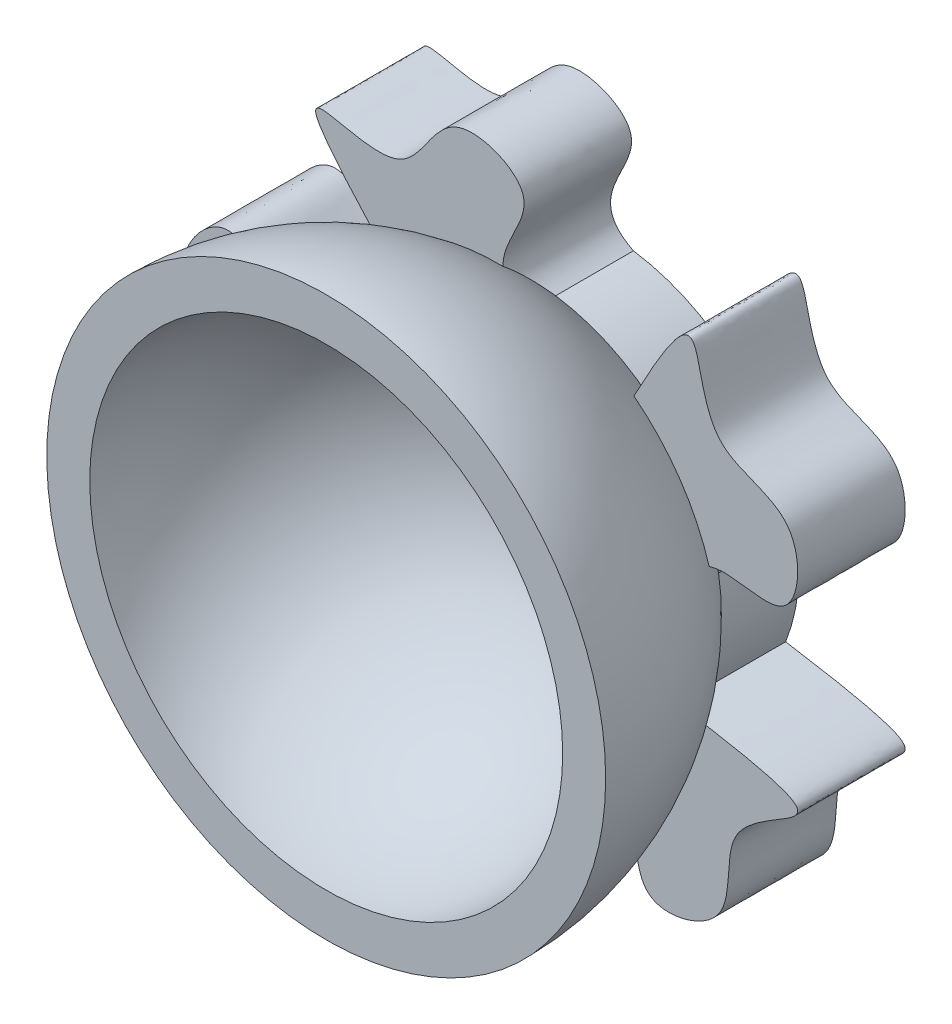
ISO-10303-21;
HEADER;
FILE_DESCRIPTION(('STEP AP214'),'2;1');
FILE_NAME('part.step','',(''),(''),'','','');
FILE_SCHEMA(('AUTOMOTIVE_DESIGN { 1 0 10303 214 1 1 1 1 }'));
ENDSEC;
DATA;
#1=APPLICATION_CONTEXT('core data for automotive mechanical design processes');
#2=APPLICATION_PROTOCOL_DEFINITION('international standard','automotive_design',2000,#1);
#3=PRODUCT_CONTEXT('',#1,'mechanical');
#4=PRODUCT('Part','Part','',(#3));
#5=PRODUCT_RELATED_PRODUCT_CATEGORY('part','',(#4));
#6=PRODUCT_DEFINITION_FORMATION('','',#4);
#7=PRODUCT_DEFINITION_CONTEXT('part definition',#1,'design');
#8=PRODUCT_DEFINITION('design','',#6,#7);
#9=PRODUCT_DEFINITION_SHAPE('','',#8);
#10=(LENGTH_UNIT() NAMED_UNIT(*) SI_UNIT(.MILLI.,.METRE.));
#11=(NAMED_UNIT(*) PLANE_ANGLE_UNIT() SI_UNIT($,.RADIAN.));
#12=(NAMED_UNIT(*) SI_UNIT($,.STERADIAN.) SOLID_ANGLE_UNIT());
#13=UNCERTAINTY_MEASURE_WITH_UNIT(LENGTH_MEASURE(1.E-05),#10,'distance_accuracy_value','');
#14=(GEOMETRIC_REPRESENTATION_CONTEXT(3) GLOBAL_UNCERTAINTY_ASSIGNED_CONTEXT((#13)) GLOBAL_UNIT_ASSIGNED_CONTEXT((#10,
#11,#12)) REPRESENTATION_CONTEXT('',''));
#15=CARTESIAN_POINT('',(0.,0.,0.));
#16=DIRECTION('',(0.,0.,1.));
#17=DIRECTION('',(1.,0.,0.));
#18=AXIS2_PLACEMENT_3D('',#15,#16,#17);
#19=CARTESIAN_POINT('',(0.,0.,0.));
#20=DIRECTION('',(0.,0.,1.));
#21=DIRECTION('',(1.,0.,0.));
#22=AXIS2_PLACEMENT_3D('',#19,#20,#21);
#23=CYLINDRICAL_SURFACE('',#22,18.);
#24=CARTESIAN_POINT('',(0.,0.,-18.7616630392937));
#25=DIRECTION('',(0.,0.,1.));
#26=DIRECTION('',(1.,0.,0.));
#27=AXIS2_PLACEMENT_3D('',#24,#25,#26);
#28=CIRCLE('',#27,18.);
#29=CARTESIAN_POINT('',(11.4569199249378,13.883046705733,-18.7616630392937));
#30=VERTEX_POINT('',#29);
#31=CARTESIAN_POINT('',(2.58343114033743,17.8136431855793,-18.7616630392937));
#32=VERTEX_POINT('',#31);
#33=EDGE_CURVE('E240',#30,#32,#28,.T.);
#34=ORIENTED_EDGE('',*,*,#33,.F.);
#35=DIRECTION('',(0.,0.,-1.));
#36=VECTOR('',#35,1.);
#37=CARTESIAN_POINT('',(11.4569199249378,13.883046705733,-16.));
#38=LINE('',#37,#36);
#39=CARTESIAN_POINT('',(11.4569199249378,13.883046705733,-26.));
#40=VERTEX_POINT('',#39);
#41=EDGE_CURVE('E154',#30,#40,#38,.T.);
#42=ORIENTED_EDGE('',*,*,#41,.T.);
#43=CARTESIAN_POINT('',(0.,0.,-26.));
#44=DIRECTION('',(0.,0.,1.));
#45=DIRECTION('',(1.,0.,0.));
#46=AXIS2_PLACEMENT_3D('',#43,#44,#45);
#47=CIRCLE('',#46,18.);
#48=CARTESIAN_POINT('',(2.58343114033743,17.8136431855793,-26.));
#49=VERTEX_POINT('',#48);
#50=EDGE_CURVE('E164',#40,#49,#47,.T.);
#51=ORIENTED_EDGE('',*,*,#50,.T.);
#52=DIRECTION('',(0.,0.,-1.));
#53=VECTOR('',#52,1.);
#54=CARTESIAN_POINT('',(2.58343114033743,17.8136431855793,-16.));
#55=LINE('',#54,#53);
#56=EDGE_CURVE('E217',#32,#49,#55,.T.);
#57=ORIENTED_EDGE('',*,*,#56,.F.);
#58=EDGE_LOOP('',(#34,#42,#51,#57));
#59=FACE_BOUND('',#58,.T.);
#60=ADVANCED_FACE('F33',(#59),#23,.T.);
#61=CARTESIAN_POINT('',(16.743944995516,-6.6060809855113,-26.));
#62=VERTEX_POINT('',#61);
#63=CARTESIAN_POINT('',(17.7401055567636,3.04772945565794,-26.));
#64=VERTEX_POINT('',#63);
#65=EDGE_CURVE('E162',#62,#64,#47,.T.);
#66=ORIENTED_EDGE('',*,*,#65,.T.);
#67=DIRECTION('',(0.,0.,-1.));
#68=VECTOR('',#67,1.);
#69=CARTESIAN_POINT('',(17.7401055567636,3.04772945565794,-16.));
#70=LINE('',#69,#68);
#71=CARTESIAN_POINT('',(17.7401055567636,3.04772945565794,-18.7616630392937));
#72=VERTEX_POINT('',#71);
#73=EDGE_CURVE('E145',#72,#64,#70,.T.);
#74=ORIENTED_EDGE('',*,*,#73,.F.);
#75=CARTESIAN_POINT('',(16.743944995516,-6.6060809855113,-18.7616630392937));
#76=VERTEX_POINT('',#75);
#77=EDGE_CURVE('E243',#76,#72,#28,.T.);
#78=ORIENTED_EDGE('',*,*,#77,.F.);
#79=DIRECTION('',(0.,0.,-1.));
#80=VECTOR('',#79,1.);
#81=CARTESIAN_POINT('',(16.743944995516,-6.6060809855113,-16.));
#82=LINE('',#81,#80);
#83=EDGE_CURVE('E168',#76,#62,#82,.T.);
#84=ORIENTED_EDGE('',*,*,#83,.T.);
#85=EDGE_LOOP('',(#66,#74,#78,#84));
#86=FACE_BOUND('',#85,.T.);
#87=ADVANCED_FACE('F167',(#86),#23,.T.);
#88=CARTESIAN_POINT('',(-1.10859281195028,-17.9658292872133,-26.));
#89=VERTEX_POINT('',#88);
#90=CARTESIAN_POINT('',(8.38055705775352,-15.9300427934685,-26.));
#91=VERTEX_POINT('',#90);
#92=EDGE_CURVE('E169',#89,#91,#47,.T.);
#93=ORIENTED_EDGE('',*,*,#92,.T.);
#94=DIRECTION('',(0.,0.,-1.));
#95=VECTOR('',#94,1.);
#96=CARTESIAN_POINT('',(8.38055705775352,-15.9300427934685,-16.));
#97=LINE('',#96,#95);
#98=CARTESIAN_POINT('',(8.38055705775352,-15.9300427934685,-18.7616630392937));
#99=VERTEX_POINT('',#98);
#100=EDGE_CURVE('E274',#99,#91,#97,.T.);
#101=ORIENTED_EDGE('',*,*,#100,.F.);
#102=CARTESIAN_POINT('',(-1.10859281195028,-17.9658292872133,-18.7616630392937));
#103=VERTEX_POINT('',#102);
#104=EDGE_CURVE('E249',#103,#99,#28,.T.);
#105=ORIENTED_EDGE('',*,*,#104,.F.);
#106=DIRECTION('',(0.,0.,-1.));
#107=VECTOR('',#106,1.);
#108=CARTESIAN_POINT('',(-1.10859281195028,-17.9658292872133,-16.));
#109=LINE('',#108,#107);
#110=EDGE_CURVE('E272',#103,#89,#109,.T.);
#111=ORIENTED_EDGE('',*,*,#110,.T.);
#112=EDGE_LOOP('',(#93,#101,#105,#111));
#113=FACE_BOUND('',#112,.T.);
#114=ADVANCED_FACE('F271',(#113),#23,.T.);
#115=CARTESIAN_POINT('',(-17.4290930329851,-4.49741215006473,-26.));
#116=VERTEX_POINT('',#115);
#117=CARTESIAN_POINT('',(-12.5606364504142,-12.8930373442617,-26.));
#118=VERTEX_POINT('',#117);
#119=EDGE_CURVE('E172',#116,#118,#47,.T.);
#120=ORIENTED_EDGE('',*,*,#119,.T.);
#121=DIRECTION('',(0.,0.,-1.));
#122=VECTOR('',#121,1.);
#123=CARTESIAN_POINT('',(-12.5606364504142,-12.8930373442617,-16.));
#124=LINE('',#123,#122);
#125=CARTESIAN_POINT('',(-12.5606364504142,-12.8930373442617,-18.7616630392937));
#126=VERTEX_POINT('',#125);
#127=EDGE_CURVE('E289',#126,#118,#124,.T.);
#128=ORIENTED_EDGE('',*,*,#127,.F.);
#129=CARTESIAN_POINT('',(-17.4290930329851,-4.49741215006473,-18.7616630392937));
#130=VERTEX_POINT('',#129);
#131=EDGE_CURVE('E251',#130,#126,#28,.T.);
#132=ORIENTED_EDGE('',*,*,#131,.F.);
#133=DIRECTION('',(0.,0.,-1.));
#134=VECTOR('',#133,1.);
#135=CARTESIAN_POINT('',(-17.4290930329851,-4.49741215006473,-16.));
#136=LINE('',#135,#134);
#137=EDGE_CURVE('E227',#130,#116,#136,.T.);
#138=ORIENTED_EDGE('',*,*,#137,.T.);
#139=EDGE_LOOP('',(#120,#128,#132,#138));
#140=FACE_BOUND('',#139,.T.);
#141=ADVANCED_FACE('F386',(#140),#23,.T.);
#142=CARTESIAN_POINT('',(0.,0.,0.));
#143=DIRECTION('',(0.,0.,1.));
#144=DIRECTION('',(-1.,0.,0.));
#145=AXIS2_PLACEMENT_3D('',#142,#143,#144);
#146=SPHERICAL_SURFACE('',#145,22.);
#147=CARTESIAN_POINT('',(0.,0.,0.));
#148=DIRECTION('',(0.,0.,1.));
#149=DIRECTION('',(1.,0.,0.));
#150=AXIS2_PLACEMENT_3D('',#147,#148,#149);
#151=CIRCLE('',#150,22.);
#152=CARTESIAN_POINT('',(22.,0.,0.));
#153=VERTEX_POINT('',#152);
#154=EDGE_CURVE('E234',#153,#153,#151,.T.);
#155=ORIENTED_EDGE('',*,*,#154,.T.);
#156=EDGE_LOOP('',(#155));
#157=FACE_BOUND('',#156,.T.);
#158=ADVANCED_FACE('F35',(#157),#146,.F.);
#159=CARTESIAN_POINT('',(0.,0.,-26.));
#160=DIRECTION('',(0.,0.,1.));
#161=DIRECTION('',(1.,0.,0.));
#162=AXIS2_PLACEMENT_3D('',#159,#160,#161);
#163=PLANE('',#162);
#164=CARTESIAN_POINT('',(-9.66317907551841,15.1862757170566,-26.));
#165=VERTEX_POINT('',#164);
#166=CARTESIAN_POINT('',(-16.1434573044402,7.96170749649315,-26.));
#167=VERTEX_POINT('',#166);
#168=EDGE_CURVE('E174',#165,#167,#47,.T.);
#169=ORIENTED_EDGE('',*,*,#168,.F.);
#170=CARTESIAN_POINT('',(-9.66317907551858,15.1862757170565,-26.));
#171=CARTESIAN_POINT('',(-24.013315635792,30.5865265173562,-26.));
#172=CARTESIAN_POINT('',(-8.68596371666601,18.103803450049,-26.));
#173=CARTESIAN_POINT('',(-5.37214905115755,31.8277498548278,-26.));
#174=CARTESIAN_POINT('',(6.8260953298461,26.9418160387639,-26.));
#175=CARTESIAN_POINT('',(-2.47743169321801,20.4092820156076,-26.));
#176=CARTESIAN_POINT('',(2.58343114033722,17.8136431855793,-26.));
#177=B_SPLINE_CURVE_WITH_KNOTS('',3,(#170,#171,#172,#173,#174,#175,#176),.UNSPECIFIED.,.F.,.F.,
(4,1,1,1,4),(0.,0.400605418784854,0.590770361322168,0.750468384788745,1.),.UNSPECIFIED.);
#178=EDGE_CURVE('E218',#165,#49,#177,.T.);
#179=ORIENTED_EDGE('',*,*,#178,.T.);
#180=ORIENTED_EDGE('',*,*,#50,.F.);
#181=CARTESIAN_POINT('',(11.4569199249378,13.883046705733,-26.));
#182=CARTESIAN_POINT('',(20.5535698925656,31.6328988008904,-26.));
#183=CARTESIAN_POINT('',(15.5173750141015,14.7777565631501,-26.));
#184=CARTESIAN_POINT('',(28.506978187392,14.7238321875629,-26.));
#185=CARTESIAN_POINT('',(27.7787843764547,1.89089119187956,-26.));
#186=CARTESIAN_POINT('',(18.6267082976742,8.64050154117533,-26.));
#187=CARTESIAN_POINT('',(17.7401055567636,3.04772945565794,-26.));
#188=B_SPLINE_CURVE_WITH_KNOTS('',3,(#181,#182,#183,#184,#185,#186,#187),.UNSPECIFIED.,.F.,.F.,
(4,1,1,1,4),(0.,0.400040512535518,0.587196796291636,0.748289369952448,1.),.UNSPECIFIED.);
#189=EDGE_CURVE('E148',#40,#64,#188,.T.);
#190=ORIENTED_EDGE('',*,*,#189,.T.);
#191=ORIENTED_EDGE('',*,*,#65,.F.);
#192=CARTESIAN_POINT('',(16.743944995516,-6.60608098551127,-26.));
#193=CARTESIAN_POINT('',(36.436076925768,-9.77250326863447,-26.));
#194=CARTESIAN_POINT('',(18.8496142630539,-10.1913227062076,-26.));
#195=CARTESIAN_POINT('',(22.812337264998,-22.5618329967212,-26.));
#196=CARTESIAN_POINT('',(10.3824608450439,-25.8348763831806,-26.));
#197=CARTESIAN_POINT('',(13.9735747080392,-15.0449904874861,-26.));
#198=CARTESIAN_POINT('',(8.38055705775356,-15.9300427934685,-26.));
#199=B_SPLINE_CURVE_WITH_KNOTS('',3,(#192,#193,#194,#195,#196,#197,#198),.UNSPECIFIED.,.F.,.F.,
(4,1,1,1,4),(0.,0.400040512535518,0.587196796291637,0.748289369952448,1.),.UNSPECIFIED.);
#200=EDGE_CURVE('E279',#62,#91,#199,.T.);
#201=ORIENTED_EDGE('',*,*,#200,.T.);
#202=ORIENTED_EDGE('',*,*,#92,.F.);
#203=CARTESIAN_POINT('',(-1.10859281195019,-17.9658292872133,-26.));
#204=CARTESIAN_POINT('',(1.96516406426458,-37.672637976076,-26.));
#205=CARTESIAN_POINT('',(-3.86767272470951,-21.0763403859049,-26.));
#206=CARTESIAN_POINT('',(-14.4081783947975,-28.6678118280354,-26.));
#207=CARTESIAN_POINT('',(-21.3620706873527,-17.857722891837,-26.));
#208=CARTESIAN_POINT('',(-9.99056418377024,-17.9388170228605,-26.));
#209=CARTESIAN_POINT('',(-12.5606364504141,-12.8930373442618,-26.));
#210=B_SPLINE_CURVE_WITH_KNOTS('',3,(#203,#204,#205,#206,#207,#208,#209),.UNSPECIFIED.,.F.,.F.,
(4,1,1,1,4),(0.,0.400040512535519,0.587196796291637,0.748289369952449,1.),.UNSPECIFIED.);
#211=EDGE_CURVE('E277',#89,#118,#210,.T.);
#212=ORIENTED_EDGE('',*,*,#211,.T.);
#213=ORIENTED_EDGE('',*,*,#119,.F.);
#214=CARTESIAN_POINT('',(-17.4290930329851,-4.49741215006487,-26.));
#215=CARTESIAN_POINT('',(-35.2215387405827,-13.5104674464503,-26.));
#216=CARTESIAN_POINT('',(-21.2399674642853,-2.8345720107436,-26.));
#217=CARTESIAN_POINT('',(-31.7170812289547,4.84415090390927,-26.));
#218=CARTESIAN_POINT('',(-23.5849465999056,14.7981966743484,-26.));
#219=CARTESIAN_POINT('',(-20.1480829403965,3.95819184939327,-26.));
#220=CARTESIAN_POINT('',(-16.1434573044403,7.96170749649302,-26.));
#221=B_SPLINE_CURVE_WITH_KNOTS('',3,(#214,#215,#216,#217,#218,#219,#220),.UNSPECIFIED.,.F.,.F.,
(4,1,1,1,4),(0.,0.400040512535519,0.587196796291638,0.748289369952449,1.),.UNSPECIFIED.);
#222=EDGE_CURVE('E404',#116,#167,#221,.T.);
#223=ORIENTED_EDGE('',*,*,#222,.T.);
#224=EDGE_LOOP('',(#169,#179,#180,#190,#191,#201,#202,#212,#213,#223));
#225=FACE_BOUND('',#224,.T.);
#226=ADVANCED_FACE('F160',(#225),#163,.F.);
#227=ORIENTED_EDGE('',*,*,#168,.T.);
#228=DIRECTION('',(0.,0.,-1.));
#229=VECTOR('',#228,1.);
#230=CARTESIAN_POINT('',(-16.1434573044402,7.96170749649315,-16.));
#231=LINE('',#230,#229);
#232=CARTESIAN_POINT('',(-16.1434573044402,7.96170749649315,-18.7616630392937));
#233=VERTEX_POINT('',#232);
#234=EDGE_CURVE('E219',#233,#167,#231,.T.);
#235=ORIENTED_EDGE('',*,*,#234,.F.);
#236=CARTESIAN_POINT('',(-9.66317907551841,15.1862757170566,-18.7616630392937));
#237=VERTEX_POINT('',#236);
#238=EDGE_CURVE('E173',#237,#233,#28,.T.);
#239=ORIENTED_EDGE('',*,*,#238,.F.);
#240=DIRECTION('',(0.,0.,-1.));
#241=VECTOR('',#240,1.);
#242=CARTESIAN_POINT('',(-9.66317907551841,15.1862757170566,-16.));
#243=LINE('',#242,#241);
#244=EDGE_CURVE('E228',#237,#165,#243,.T.);
#245=ORIENTED_EDGE('',*,*,#244,.T.);
#246=EDGE_LOOP('',(#227,#235,#239,#245));
#247=FACE_BOUND('',#246,.T.);
#248=ADVANCED_FACE('F380',(#247),#23,.T.);
#249=CARTESIAN_POINT('',(0.,0.,0.));
#250=DIRECTION('',(0.,0.,1.));
#251=DIRECTION('',(-1.,0.,0.));
#252=AXIS2_PLACEMENT_3D('',#249,#250,#251);
#253=SPHERICAL_SURFACE('',#252,26.);
#254=ORIENTED_EDGE('',*,*,#77,.T.);
#255=CARTESIAN_POINT('',(17.7401055567636,3.04772945565792,-18.7616630392937));
#256=CARTESIAN_POINT('',(17.7509138919469,3.11591256068419,-18.7403675625229));
#257=CARTESIAN_POINT('',(17.762572806785,3.18361136286988,-18.7179285422996));
#258=CARTESIAN_POINT('',(17.7876876426541,3.31790717215349,-18.6706959137359));
#259=CARTESIAN_POINT('',(17.8011450249245,3.38450323330495,-18.6459003955436));
#260=CARTESIAN_POINT('',(17.8299381349842,3.51636147809571,-18.5939167238656));
#261=CARTESIAN_POINT('',(17.8452742383676,3.58162339195899,-18.5667280922549));
#262=CARTESIAN_POINT('',(17.8778338513743,3.7103382899067,-18.5100414989566));
#263=CARTESIAN_POINT('',(17.8950497588669,3.77379734135349,-18.4805529672259));
#264=CARTESIAN_POINT('',(17.9314751939256,3.8989400734999,-18.4191653293943));
#265=CARTESIAN_POINT('',(17.9506843386993,3.96062409219103,-18.3872666864633));
#266=CARTESIAN_POINT('',(17.9911421741128,4.08200382529401,-18.3210599316743));
#267=CARTESIAN_POINT('',(18.0123909842957,4.14169942288965,-18.2867516786227));
#268=CARTESIAN_POINT('',(18.0610834789379,4.2697420744739,-18.2091696039357));
#269=CARTESIAN_POINT('',(18.0889451268742,4.33763976260524,-18.1654132445722));
#270=CARTESIAN_POINT('',(18.1475564544554,4.46995493609152,-18.0746506180986));
#271=CARTESIAN_POINT('',(18.1783068468208,4.53437155637802,-18.0276435497218));
#272=CARTESIAN_POINT('',(18.2426167269497,4.65936848680798,-17.930547033953));
#273=CARTESIAN_POINT('',(18.2761762336464,4.71994877109027,-17.8804575657867));
#274=CARTESIAN_POINT('',(18.3460609651515,4.83714004717053,-17.7772736565673));
#275=CARTESIAN_POINT('',(18.3823931996327,4.89374023374181,-17.7241716928245));
#276=CARTESIAN_POINT('',(18.4575543586348,5.0025851615084,-17.6153388806883));
#277=CARTESIAN_POINT('',(18.4963832784491,5.05482991091375,-17.5596080372508));
#278=CARTESIAN_POINT('',(18.5762887053968,5.15482926156606,-17.4458179930094));
#279=CARTESIAN_POINT('',(18.6173646641946,5.20258495059598,-17.3877593611617));
#280=CARTESIAN_POINT('',(18.7078909138776,5.30049992786854,-17.2606269287751));
#281=CARTESIAN_POINT('',(18.7576662146577,5.34992455081787,-17.191218385103));
#282=CARTESIAN_POINT('',(18.8594394797751,5.44292183615721,-17.0500991427711));
#283=CARTESIAN_POINT('',(18.9114385052876,5.48649166258017,-16.9783873491431));
#284=CARTESIAN_POINT('',(19.0172515497963,5.5680292043949,-16.8330314190139));
#285=CARTESIAN_POINT('',(19.0710672119387,5.60599167155716,-16.7593855472728));
#286=CARTESIAN_POINT('',(19.1800387811636,5.67659083827018,-16.6106042971062));
#287=CARTESIAN_POINT('',(19.2351942389789,5.70922929552787,-16.5354694194965));
#288=CARTESIAN_POINT('',(19.3464368777923,5.76956612843454,-16.3840536024777));
#289=CARTESIAN_POINT('',(19.4025231261422,5.7972691570371,-16.3077738168183));
#290=CARTESIAN_POINT('',(19.5151906391443,5.84812422188209,-16.1544560570866));
#291=CARTESIAN_POINT('',(19.5717698312335,5.87129009490101,-16.077421165021));
#292=CARTESIAN_POINT('',(19.6285269558117,5.89244682156511,-16.));
#293=B_SPLINE_CURVE_WITH_KNOTS('',3,(#255,#256,#257,#258,#259,#260,#261,#262,#263,#264,#265,
#266,#267,#268,#269,#270,#271,#272,#273,#274,#275,#276,#277,#278,#279,#280,#281,#282,#283,#284,
#285,#286,#287,#288,#289,#290,#291,#292),.UNSPECIFIED.,.F.,.F.,(4,2,2,2,2,2,2,2,2,2,2,2,2,2,2,2,
2,2,4),(0.,0.216728320920888,0.433633814643095,0.650582743141824,0.866684707796222,
1.08274524755853,1.29881845818754,1.55497437940821,1.81119366707632,2.06741468176375,
2.32430638780545,2.58119760959345,2.83802642051028,3.13382242784371,3.4297612013595,
3.72597522827774,4.02209126216409,4.31792663337857,4.61284525769002),.UNSPECIFIED.);
#294=CARTESIAN_POINT('',(19.6285269558117,5.89244682156511,-16.));
#295=VERTEX_POINT('',#294);
#296=EDGE_CURVE('E11',#72,#295,#293,.T.);
#297=ORIENTED_EDGE('',*,*,#296,.T.);
#298=CARTESIAN_POINT('',(0.,0.,-16.));
#299=DIRECTION('',(0.,0.,1.));
#300=DIRECTION('',(1.,0.,0.));
#301=AXIS2_PLACEMENT_3D('',#298,#299,#300);
#302=CIRCLE('',#301,20.4939015319192);
#303=CARTESIAN_POINT('',(12.6291499742494,16.1401539933148,-16.));
#304=VERTEX_POINT('',#303);
#305=EDGE_CURVE('E374',#295,#304,#302,.T.);
#306=ORIENTED_EDGE('',*,*,#305,.T.);
#307=CARTESIAN_POINT('',(12.6291499742494,16.1401539933148,-16.));
#308=CARTESIAN_POINT('',(12.58369972026,16.0539766253289,-16.1228074102187));
#309=CARTESIAN_POINT('',(12.5377951268963,15.9667600313744,-16.2447174117457));
#310=CARTESIAN_POINT('',(12.445141288765,15.7903677495196,-16.4865783644583));
#311=CARTESIAN_POINT('',(12.3983929510448,15.7011941454965,-16.6065311829262));
#312=CARTESIAN_POINT('',(12.3040550922364,15.5208928704422,-16.8444828980936));
#313=CARTESIAN_POINT('',(12.2564661633189,15.4297665660836,-16.9624830651226));
#314=CARTESIAN_POINT('',(12.1604493999507,15.2455632754958,-17.1965329261121));
#315=CARTESIAN_POINT('',(12.1120218559749,15.1524869624457,-17.3125832690471));
#316=CARTESIAN_POINT('',(12.0143289363249,14.9643849877992,-17.5427351397641));
#317=CARTESIAN_POINT('',(11.9650635606001,14.8693593260854,-17.6568366674287));
#318=CARTESIAN_POINT('',(11.8656949588163,14.6773581843323,-17.8830906362648));
#319=CARTESIAN_POINT('',(11.8155914537635,14.5803820527622,-17.9952424020109));
#320=CARTESIAN_POINT('',(11.7145455584576,14.3844777161248,-18.217594420936));
#321=CARTESIAN_POINT('',(11.663602621818,14.2855482305855,-18.3277932976504));
#322=CARTESIAN_POINT('',(11.5608758212511,14.0857333166192,-18.5462352922278));
#323=CARTESIAN_POINT('',(11.509091153526,13.9848459983109,-18.6544763033678));
#324=CARTESIAN_POINT('',(11.4569199249378,13.883046705733,-18.7616630392937));
#325=B_SPLINE_CURVE_WITH_KNOTS('',3,(#307,#308,#309,#310,#311,#312,#313,#314,#315,#316,#317,
#318,#319,#320,#321,#322,#323,#324),.UNSPECIFIED.,.F.,.F.,(4,2,2,2,2,2,2,2,4),(0.,
0.470275490635467,0.940072431219376,1.40955066306177,1.87886940924031,2.34818818370071,
2.81766642137957,3.28746336360577,3.75773889502617),.UNSPECIFIED.);
#326=EDGE_CURVE('E47',#304,#30,#325,.T.);
#327=ORIENTED_EDGE('',*,*,#326,.T.);
#328=ORIENTED_EDGE('',*,*,#33,.T.);
#329=CARTESIAN_POINT('',(2.58343114033693,17.8136431855793,-18.7616630392937));
#330=CARTESIAN_POINT('',(2.52229391707372,17.8449989007875,-18.7403105158753));
#331=CARTESIAN_POINT('',(2.46186804598104,17.8769968445429,-18.7178356376939));
#332=CARTESIAN_POINT('',(2.34259389080114,17.9423241187319,-18.6705768884542));
#333=CARTESIAN_POINT('',(2.28374687433139,17.9756544684375,-18.6457912295976));
#334=CARTESIAN_POINT('',(2.16787044401476,18.0436510179228,-18.5938749280368));
#335=CARTESIAN_POINT('',(2.11084137409147,18.0783174677609,-18.566743845181));
#336=CARTESIAN_POINT('',(1.97110300930335,18.1664815506172,-18.496088506126));
#337=CARTESIAN_POINT('',(1.88964895249081,18.220809792687,-18.4510951791729));
#338=CARTESIAN_POINT('',(1.73206525327265,18.3324178724376,-18.3557619737816));
#339=CARTESIAN_POINT('',(1.65593508941955,18.3896974200963,-18.3054226201787));
#340=CARTESIAN_POINT('',(1.52415490147315,18.495495290806,-18.209917109063));
#341=CARTESIAN_POINT('',(1.46742526171182,18.543515980108,-18.1656861240401));
#342=CARTESIAN_POINT('',(1.35822404072457,18.6412543977626,-18.0739131834112));
#343=CARTESIAN_POINT('',(1.30575353418508,18.6909725499596,-18.026370397743));
#344=CARTESIAN_POINT('',(1.20540406877134,18.791918132803,-17.9281424421939));
#345=CARTESIAN_POINT('',(1.15752514325271,18.8431455744102,-17.8774572494893));
#346=CARTESIAN_POINT('',(1.0664946460175,18.9470149267165,-17.7730337052995));
#347=CARTESIAN_POINT('',(1.02335451630016,18.9996598946911,-17.7192884199894));
#348=CARTESIAN_POINT('',(0.942086202782509,19.1059964167227,-17.6091137495991));
#349=CARTESIAN_POINT('',(0.903958011986809,19.1596879693189,-17.5526843682653));
#350=CARTESIAN_POINT('',(0.832774036999166,19.2678333574338,-17.4374480474905));
#351=CARTESIAN_POINT('',(0.799716979825084,19.3222869978916,-17.378641709424));
#352=CARTESIAN_POINT('',(0.734667168998567,19.4387636836367,-17.2512115992763));
#353=CARTESIAN_POINT('',(0.703362449518363,19.5008565890292,-17.1823003299524));
#354=CARTESIAN_POINT('',(0.646910375393072,19.6253399277807,-17.0422158745078));
#355=CARTESIAN_POINT('',(0.621765795912717,19.6877304823759,-16.9710416851865));
#356=CARTESIAN_POINT('',(0.57728760756905,19.8125065566397,-16.8267917484098));
#357=CARTESIAN_POINT('',(0.557959201513845,19.8748920221869,-16.7537143615725));
#358=CARTESIAN_POINT('',(0.524713046117149,19.9993252172188,-16.6060611225199));
#359=CARTESIAN_POINT('',(0.510795617005849,20.0613729265003,-16.5314851818926));
#360=CARTESIAN_POINT('',(0.487904006557148,20.1848430246716,-16.3811977941678));
#361=CARTESIAN_POINT('',(0.47892536219859,20.2462659287391,-16.305487435985));
#362=CARTESIAN_POINT('',(0.465418647300232,20.3681980887946,-16.1533099386404));
#363=CARTESIAN_POINT('',(0.460877375756582,20.428709524238,-16.0768457319784));
#364=CARTESIAN_POINT('',(0.458293518523272,20.4887766118644,-16.));
#365=B_SPLINE_CURVE_WITH_KNOTS('',3,(#329,#330,#331,#332,#333,#334,#335,#336,#337,#338,#339,
#340,#341,#342,#343,#344,#345,#346,#347,#348,#349,#350,#351,#352,#353,#354,#355,#356,#357,#358,
#359,#360,#361,#362,#363,#364),.UNSPECIFIED.,.F.,.F.,(4,2,2,2,2,2,2,2,2,2,2,2,2,2,2,2,2,4),(0.,
0.21584977193247,0.431867950133102,0.647926755533108,0.970888331430072,1.29381823049565,
1.55311613628895,1.8124792673871,2.07184428249032,2.33182238222914,2.59180011910126,
2.85171248785209,3.14517079429225,3.43876106262336,3.73261318417814,4.02648269372097,
4.32008620471171,4.61281357346376),.UNSPECIFIED.);
#366=CARTESIAN_POINT('',(0.458293518523272,20.4887766118644,-16.));
#367=VERTEX_POINT('',#366);
#368=EDGE_CURVE('E190',#32,#367,#365,.T.);
#369=ORIENTED_EDGE('',*,*,#368,.T.);
#370=CARTESIAN_POINT('',(0.,0.,-16.));
#371=DIRECTION('',(0.,0.,1.));
#372=DIRECTION('',(1.,0.,0.));
#373=AXIS2_PLACEMENT_3D('',#370,#371,#372);
#374=CIRCLE('',#373,20.4939015319192);
#375=CARTESIAN_POINT('',(-11.3800766328884,17.043880304367,-16.));
#376=VERTEX_POINT('',#375);
#377=EDGE_CURVE('E178',#367,#376,#374,.T.);
#378=ORIENTED_EDGE('',*,*,#377,.T.);
#379=CARTESIAN_POINT('',(-11.3800766328884,17.043880304367,-16.));
#380=CARTESIAN_POINT('',(-11.3146288937385,16.9723925937587,-16.1227020417167));
#381=CARTESIAN_POINT('',(-11.248378619971,16.9001197282325,-16.2445185719861));
#382=CARTESIAN_POINT('',(-11.1143618520165,16.7541018461106,-16.4862194098667));
#383=CARTESIAN_POINT('',(-11.046596939771,16.6803583734199,-16.6061055273421));
#384=CARTESIAN_POINT('',(-10.9095544814726,16.5314040548396,-16.8439505441548));
#385=CARTESIAN_POINT('',(-10.8402779735863,16.4561942196087,-16.9619106746095));
#386=CARTESIAN_POINT('',(-10.7002147495825,16.304310345384,-17.1959070819895));
#387=CARTESIAN_POINT('',(-10.6294285451392,16.2276368033734,-17.3119439877731));
#388=CARTESIAN_POINT('',(-10.4863468553767,16.0728269116075,-17.5420955633644));
#389=CARTESIAN_POINT('',(-10.4140513700002,15.9946905617969,-17.6562102330991));
#390=CARTESIAN_POINT('',(-10.2679507285966,15.836954854667,-17.8825170834072));
#391=CARTESIAN_POINT('',(-10.1941450767208,15.7573550177254,-17.9947086095717));
#392=CARTESIAN_POINT('',(-10.0450224023003,15.596690615712,-18.2171668207695));
#393=CARTESIAN_POINT('',(-9.96970440468702,15.5156251092531,-18.3274321722856));
#394=CARTESIAN_POINT('',(-9.81755417016506,15.3520261986782,-18.5460339090736));
#395=CARTESIAN_POINT('',(-9.74072049333729,15.2694914067745,-18.6543682535408));
#396=CARTESIAN_POINT('',(-9.66317907551858,15.1862757170565,-18.7616630392937));
#397=B_SPLINE_CURVE_WITH_KNOTS('',3,(#379,#380,#381,#382,#383,#384,#385,#386,#387,#388,#389,
#390,#391,#392,#393,#394,#395,#396),.UNSPECIFIED.,.F.,.F.,(4,2,2,2,2,2,2,2,4),(0.,
0.469085355361321,0.937701775908157,1.40600589473253,1.87415373946675,2.34230160193561,
2.81060572441898,3.27922214599702,3.74830752692747),.UNSPECIFIED.);
#398=EDGE_CURVE('E182',#376,#237,#397,.T.);
#399=ORIENTED_EDGE('',*,*,#398,.T.);
#400=ORIENTED_EDGE('',*,*,#238,.T.);
#401=CARTESIAN_POINT('',(-16.1434573044405,7.96170749649268,-18.7616630392937));
#402=CARTESIAN_POINT('',(-16.1922784548746,7.91289918581981,-18.7403675625228));
#403=CARTESIAN_POINT('',(-16.2415030726373,7.86498264255238,-18.7179285422995));
#404=CARTESIAN_POINT('',(-16.3407584978079,7.77109718070623,-18.6706959137358));
#405=CARTESIAN_POINT('',(-16.3907899313701,7.72512988630929,-18.6459003955435));
#406=CARTESIAN_POINT('',(-16.4915883784104,7.63537849088579,-18.5939167238654));
#407=CARTESIAN_POINT('',(-16.5423555371804,7.59159482888142,-18.5667280922548));
#408=CARTESIAN_POINT('',(-16.6443535361971,7.50660034935819,-18.5100414989565));
#409=CARTESIAN_POINT('',(-16.695581792497,7.46538015481978,-18.4805529672257));
#410=CARTESIAN_POINT('',(-16.7986076408743,7.38554789132667,-18.4191653293941));
#411=CARTESIAN_POINT('',(-16.8504051219324,7.34693532393133,-18.3872666864631));
#412=CARTESIAN_POINT('',(-16.9544814153827,7.27251757607408,-18.3210599316741));
#413=CARTESIAN_POINT('',(-17.0067602558244,7.23671256038411,-18.2867516786225));
#414=CARTESIAN_POINT('',(-17.1214148937541,7.16174460949569,-18.2091696039355));
#415=CARTESIAN_POINT('',(-17.1838647001742,7.12319089168019,-18.1654132445719));
#416=CARTESIAN_POINT('',(-17.30905516788,7.05059654168567,-18.0746506180984));
#417=CARTESIAN_POINT('',(-17.3717958972942,7.01655702828829,-18.0276435497216));
#418=CARTESIAN_POINT('',(-17.4972950355133,6.95323278644229,-17.9305470339528));
#419=CARTESIAN_POINT('',(-17.5600534444345,6.92394809004436,-17.8804575657865));
#420=CARTESIAN_POINT('',(-17.6854746836467,6.87021557064211,-17.7772736565672));
#421=CARTESIAN_POINT('',(-17.7481368337292,6.84578060943208,-17.7241716928243));
#422=CARTESIAN_POINT('',(-17.8729209320068,6.80190183392403,-17.6153388806882));
#423=CARTESIAN_POINT('',(-17.93504288122,6.78245801021754,-17.5596080372507));
#424=CARTESIAN_POINT('',(-18.0584658731157,6.74852406765139,-17.4458179930094));
#425=CARTESIAN_POINT('',(-18.1197671115681,6.73403274645319,-17.3877593611617));
#426=CARTESIAN_POINT('',(-18.2505573656181,6.70802786034488,-17.260626928775));
#427=CARTESIAN_POINT('',(-18.319877494319,6.69729968816529,-17.1912183851029));
#428=CARTESIAN_POINT('',(-18.4568762281978,6.68188412820872,-17.050099142771));
#429=CARTESIAN_POINT('',(-18.5245540249446,6.67719965852036,-16.9783873491431));
#430=CARTESIAN_POINT('',(-18.6580851407656,6.67342974857508,-16.8330314190139));
#431=CARTESIAN_POINT('',(-18.723936704341,6.67434952004209,-16.7593855472728));
#432=CARTESIAN_POINT('',(-18.8535937047657,6.68128547569212,-16.6106042971062));
#433=CARTESIAN_POINT('',(-18.9173998113044,6.6872999737877,-16.5354694194965));
#434=CARTESIAN_POINT('',(-19.0428620971561,6.7038732331001,-16.3840536024777));
#435=CARTESIAN_POINT('',(-19.1045202568783,6.71442768180143,-16.3077738168182));
#436=CARTESIAN_POINT('',(-19.2255620467313,6.73950937264694,-16.1544560570866));
#437=CARTESIAN_POINT('',(-19.2849521331765,6.75402420238177,-16.0774211650209));
#438=CARTESIAN_POINT('',(-19.343305223432,6.77026905175473,-16.));
#439=B_SPLINE_CURVE_WITH_KNOTS('',3,(#401,#402,#403,#404,#405,#406,#407,#408,#409,#410,#411,
#412,#413,#414,#415,#416,#417,#418,#419,#420,#421,#422,#423,#424,#425,#426,#427,#428,#429,#430,
#431,#432,#433,#434,#435,#436,#437,#438),.UNSPECIFIED.,.F.,.F.,(4,2,2,2,2,2,2,2,2,2,2,2,2,2,2,2,
2,2,4),(0.,0.216728320920893,0.433633814643106,0.650582743141842,0.866684707796254,
1.08274524755857,1.2988184581876,1.5549743794082,1.81119366707623,2.06741468176358,
2.32430638780521,2.58119760959313,2.83802642050988,3.1338224278433,3.42976120135908,
3.7259752282773,4.02209126216365,4.31792663337812,4.61284525768957),.UNSPECIFIED.);
#440=CARTESIAN_POINT('',(-19.343305223432,6.77026905175474,-16.));
#441=VERTEX_POINT('',#440);
#442=EDGE_CURVE('E430',#233,#441,#439,.T.);
#443=ORIENTED_EDGE('',*,*,#442,.T.);
#444=CARTESIAN_POINT('',(0.,0.,-16.));
#445=DIRECTION('',(0.,0.,1.));
#446=DIRECTION('',(1.,0.,0.));
#447=AXIS2_PLACEMENT_3D('',#444,#445,#446);
#448=CIRCLE('',#447,20.4939015319192);
#449=CARTESIAN_POINT('',(-19.7041414406776,-5.63443076856666,-16.));
#450=VERTEX_POINT('',#449);
#451=EDGE_CURVE('E569',#441,#450,#448,.T.);
#452=ORIENTED_EDGE('',*,*,#451,.T.);
#453=CARTESIAN_POINT('',(-19.7041414406776,-5.63443076856666,-16.));
#454=CARTESIAN_POINT('',(-19.616717626818,-5.5914268023434,-16.1228074102187));
#455=CARTESIAN_POINT('',(-19.5283154029853,-5.54784913863445,-16.2447174117457));
#456=CARTESIAN_POINT('',(-19.3496760914505,-5.4596053445592,-16.4865783644583));
#457=CARTESIAN_POINT('',(-19.2594409624376,-5.41494036693594,-16.6065311829262));
#458=CARTESIAN_POINT('',(-19.0771416010022,-5.32452397345001,-16.8444828980937));
#459=CARTESIAN_POINT('',(-18.9850786509659,-5.2787733151794,-16.9624830651226));
#460=CARTESIAN_POINT('',(-18.7991274800249,-5.18618696015482,-17.1965329261121));
#461=CARTESIAN_POINT('',(-18.7052398898041,-5.13935163727718,-17.3125832690471));
#462=CARTESIAN_POINT('',(-18.5156410909528,-5.04459640053641,-17.5427351397641));
#463=CARTESIAN_POINT('',(-18.4199298822124,-4.99667648660792,-17.6568366674287));
#464=CARTESIAN_POINT('',(-18.2266835551163,-4.89975169865971,-17.8830906362648));
#465=CARTESIAN_POINT('',(-18.1291478280895,-4.85074646152892,-17.9952424020109));
#466=CARTESIAN_POINT('',(-17.9322503016396,-4.751649810983,-18.217594420936));
#467=CARTESIAN_POINT('',(-17.832887307538,-4.70155768280218,-18.3277932976504));
#468=CARTESIAN_POINT('',(-17.6323313204841,-4.60028532006233,-18.5462352922278));
#469=CARTESIAN_POINT('',(-17.5311365664014,-4.54910402901764,-18.6544763033678));
#470=CARTESIAN_POINT('',(-17.4290930329851,-4.49741215006487,-18.7616630392937));
#471=B_SPLINE_CURVE_WITH_KNOTS('',3,(#453,#454,#455,#456,#457,#458,#459,#460,#461,#462,#463,
#464,#465,#466,#467,#468,#469,#470),.UNSPECIFIED.,.F.,.F.,(4,2,2,2,2,2,2,2,4),(0.,
0.470275490635464,0.940072431219371,1.40955066306177,1.87886940924031,2.3481881837007,
2.81766642137957,3.28746336360576,3.75773889502616),.UNSPECIFIED.);
#472=EDGE_CURVE('E424',#450,#130,#471,.T.);
#473=ORIENTED_EDGE('',*,*,#472,.T.);
#474=ORIENTED_EDGE('',*,*,#131,.T.);
#475=CARTESIAN_POINT('',(-12.5606364504139,-12.8930373442619,-18.7616630392937));
#476=CARTESIAN_POINT('',(-12.5293035536682,-12.95455161498,-18.7403675625228));
#477=CARTESIAN_POINT('',(-12.4989434563856,-13.0161740346467,-18.7179285422996));
#478=CARTESIAN_POINT('',(-12.4403246892731,-13.1395837567681,-18.6706959137358));
#479=CARTESIAN_POINT('',(-12.4120677576241,-13.2013711528311,-18.6459003955435));
#480=CARTESIAN_POINT('',(-12.357857541302,-13.3249708791759,-18.5939167238655));
#481=CARTESIAN_POINT('',(-12.3319047190616,-13.3867832119732,-18.5667280922548));
#482=CARTESIAN_POINT('',(-12.2825892805503,-13.5100538121878,-18.5100414989565));
#483=CARTESIAN_POINT('',(-12.2592169477204,-13.5715125197841,-18.4805529672258));
#484=CARTESIAN_POINT('',(-12.2151286913232,-13.6941654503489,-18.4191653293941));
#485=CARTESIAN_POINT('',(-12.1944122594037,-13.7553597217585,-18.3872666864632));
#486=CARTESIAN_POINT('',(-12.1557981187638,-13.8773385076073,-18.3210599316742));
#487=CARTESIAN_POINT('',(-12.1379005754185,-13.9381229978058,-18.2867516786226));
#488=CARTESIAN_POINT('',(-12.1020320488169,-14.0703324091903,-18.2091696039355));
#489=CARTESIAN_POINT('',(-12.0846633357403,-14.1416394585288,-18.165413244572));
#490=CARTESIAN_POINT('',(-12.0543079881866,-14.2831355564624,-18.0746506180984));
#491=CARTESIAN_POINT('',(-12.041322438787,-14.3533243241289,-18.0276435497217));
#492=CARTESIAN_POINT('',(-12.019878872429,-14.4922493642079,-17.9305470339529));
#493=CARTESIAN_POINT('',(-12.0114208859886,-14.5609856268268,-17.8804575657866));
#494=CARTESIAN_POINT('',(-11.9990755176463,-14.6968725753074,-17.7772736565672));
#495=CARTESIAN_POINT('',(-11.9952001578417,-14.7640186397392,-17.7241716928244));
#496=CARTESIAN_POINT('',(-11.9920293694632,-14.8962546568605,-17.6153388806882));
#497=CARTESIAN_POINT('',(-11.992733932256,-14.9613446134255,-17.5596080372507));
#498=CARTESIAN_POINT('',(-11.9986006370473,-15.0892130190677,-17.4458179930094));
#499=CARTESIAN_POINT('',(-12.00376169605,-15.1519920258761,-17.3877593611617));
#500=CARTESIAN_POINT('',(-12.0194459908613,-15.2844169010024,-17.260626928775));
#501=CARTESIAN_POINT('',(-12.0306639906228,-15.353659448636,-17.1912183851029));
#502=CARTESIAN_POINT('',(-12.0583378588501,-15.4887166572199,-17.050099142771));
#503=CARTESIAN_POINT('',(-12.0747962527642,-15.5545296475678,-16.9783873491431));
#504=CARTESIAN_POINT('',(-12.1124742394115,-15.6826902516379,-16.8330314190139));
#505=CARTESIAN_POINT('',(-12.1336982463096,-15.7450345852702,-16.7593855472728));
#506=CARTESIAN_POINT('',(-12.1803609486982,-15.8662023922393,-16.6106042971061));
#507=CARTESIAN_POINT('',(-12.2057982475696,-15.9250270235182,-16.5354694194965));
#508=CARTESIAN_POINT('',(-12.2603303323163,-16.0392273292471,-16.3840536024776));
#509=CARTESIAN_POINT('',(-12.2894216287256,-16.0946062198187,-16.3077738168182));
#510=CARTESIAN_POINT('',(-12.3506797043381,-16.2019731340835,-16.1544560570866));
#511=CARTESIAN_POINT('',(-12.3828366737492,-16.253971133742,-16.0774211650209));
#512=CARTESIAN_POINT('',(-12.4163185401649,-16.3044482859482,-16.));
#513=B_SPLINE_CURVE_WITH_KNOTS('',3,(#475,#476,#477,#478,#479,#480,#481,#482,#483,#484,#485,
#486,#487,#488,#489,#490,#491,#492,#493,#494,#495,#496,#497,#498,#499,#500,#501,#502,#503,#504,
#505,#506,#507,#508,#509,#510,#511,#512),.UNSPECIFIED.,.F.,.F.,(4,2,2,2,2,2,2,2,2,2,2,2,2,2,2,2,
2,2,4),(0.,0.216728320920896,0.43363381464311,0.650582743141847,0.866684707796257,
1.08274524755857,1.29881845818759,1.55497437940822,1.81119366707628,2.06741468176366,
2.32430638780531,2.58119760959326,2.83802642051003,3.13382242784345,3.42976120135923,
3.72597522827746,4.02209126216381,4.31792663337828,4.61284525768972),.UNSPECIFIED.);
#514=CARTESIAN_POINT('',(-12.4163185401649,-16.3044482859482,-16.));
#515=VERTEX_POINT('',#514);
#516=EDGE_CURVE('E314',#126,#515,#513,.T.);
#517=ORIENTED_EDGE('',*,*,#516,.T.);
#518=CARTESIAN_POINT('',(0.,0.,-16.));
#519=DIRECTION('',(0.,0.,1.));
#520=DIRECTION('',(1.,0.,0.));
#521=AXIS2_PLACEMENT_3D('',#518,#519,#520);
#522=CIRCLE('',#521,20.4939015319192);
#523=CARTESIAN_POINT('',(-0.730252466677795,-20.480886976274,-16.));
#524=VERTEX_POINT('',#523);
#525=EDGE_CURVE('E435',#515,#524,#522,.T.);
#526=ORIENTED_EDGE('',*,*,#525,.T.);
#527=CARTESIAN_POINT('',(-0.730252466677795,-20.480886976274,-16.));
#528=CARTESIAN_POINT('',(-0.744136224785279,-20.384453032035,-16.1228074102187));
#529=CARTESIAN_POINT('',(-0.758263256315741,-20.2869112823427,-16.2447174117457));
#530=CARTESIAN_POINT('',(-0.786985508565937,-20.0897463690237,-16.4865783644583));
#531=CARTESIAN_POINT('',(-0.801580238230092,-19.9901254244382,-16.6065311829262));
#532=CARTESIAN_POINT('',(-0.831237737687556,-19.7888082266714,-16.8444828980937));
#533=CARTESIAN_POINT('',(-0.846300183247121,-19.6871134272205,-16.9624830651226));
#534=CARTESIAN_POINT('',(-0.876892967568561,-19.4816525972345,-17.1965329261121));
#535=CARTESIAN_POINT('',(-0.892423145644987,-19.3778872820496,-17.3125832690471));
#536=CARTESIAN_POINT('',(-0.92395148004227,-19.1682871304614,-17.5427351397641));
#537=CARTESIAN_POINT('',(-0.939949636391326,-19.0624522939335,-17.6568366674287));
#538=CARTESIAN_POINT('',(-0.972414188386734,-18.8487127086464,-17.8830906362648));
#539=CARTESIAN_POINT('',(-0.988880741282573,-18.7408072687992,-17.9952424020109));
#540=CARTESIAN_POINT('',(-1.02228257470388,-18.5229240441223,-18.217594420936));
#541=CARTESIAN_POINT('',(-1.03921816583598,-18.4129449022111,-18.3277932976504));
#542=CARTESIAN_POINT('',(-1.07355869801703,-18.1909099426944,-18.5462352922278));
#543=CARTESIAN_POINT('',(-1.09096409962435,-18.0788521236823,-18.6544763033678));
#544=CARTESIAN_POINT('',(-1.10859281195019,-17.9658292872133,-18.7616630392937));
#545=B_SPLINE_CURVE_WITH_KNOTS('',3,(#527,#528,#529,#530,#531,#532,#533,#534,#535,#536,#537,
#538,#539,#540,#541,#542,#543,#544),.UNSPECIFIED.,.F.,.F.,(4,2,2,2,2,2,2,2,4),(0.,
0.470275490635464,0.940072431219378,1.40955066306178,1.87886940924032,2.34818818370071,
2.81766642137958,3.28746336360578,3.75773889502618),.UNSPECIFIED.);
#546=EDGE_CURVE('E267',#524,#103,#545,.T.);
#547=ORIENTED_EDGE('',*,*,#546,.T.);
#548=ORIENTED_EDGE('',*,*,#104,.T.);
#549=CARTESIAN_POINT('',(8.38055705775374,-15.9300427934684,-18.7616630392937));
#550=CARTESIAN_POINT('',(8.44874300334275,-15.9192523928924,-18.7403675625229));
#551=CARTESIAN_POINT('',(8.51673119312778,-15.909420599448,-18.7179285422996));
#552=CARTESIAN_POINT('',(8.65221500875257,-15.891806540415,-18.6706959137358));
#553=CARTESIAN_POINT('',(8.71971018649163,-15.8840259568613,-18.6459003955435));
#554=CARTESIAN_POINT('',(8.85401238975646,-15.8706633933191,-18.5939167238655));
#555=CARTESIAN_POINT('',(8.92081927477501,-15.8650818539074,-18.5667280922548));
#556=CARTESIAN_POINT('',(9.0532958909618,-15.8562727951304,-18.5100414989565));
#557=CARTESIAN_POINT('',(9.11896904334696,-15.8530361707911,-18.4805529672258));
#558=CARTESIAN_POINT('',(9.24924293268244,-15.8490075872069,-18.4191653293941));
#559=CARTESIAN_POINT('',(9.31384387279239,-15.8482151594594,-18.3872666864632));
#560=CARTESIAN_POINT('',(9.44178501760454,-15.8491844471631,-18.3210599316742));
#561=CARTESIAN_POINT('',(9.50512514814877,-15.8509463124047,-18.2867516786226));
#562=CARTESIAN_POINT('',(9.64194775464462,-15.8576882713845,-18.2091696039356));
#563=CARTESIAN_POINT('',(9.71513201608691,-15.8632047336977,-18.165413244572));
#564=CARTESIAN_POINT('',(9.85908312032119,-15.8780597815015,-18.0746506180985));
#565=CARTESIAN_POINT('',(9.92984936062696,-15.8873993121505,-18.0276435497217));
#566=CARTESIAN_POINT('',(10.0686013516953,-15.9099354669618,-17.9305470339529));
#567=CARTESIAN_POINT('',(10.1365870837131,-15.923132117122,-17.8804575657866));
#568=CARTESIAN_POINT('',(10.2696381801645,-15.9533823505082,-17.7772736565673));
#569=CARTESIAN_POINT('',(10.334695434325,-15.9704459393278,-17.7241716928244));
#570=CARTESIAN_POINT('',(10.4614391875916,-16.0082935169376,-17.6153388806882));
#571=CARTESIAN_POINT('',(10.5231256930516,-16.0290774987146,-17.5596080372507));
#572=CARTESIAN_POINT('',(10.6429228619844,-16.0741705769226,-17.4458179930094));
#573=CARTESIAN_POINT('',(10.7010343905552,-16.0984788157119,-17.3877593611617));
#574=CARTESIAN_POINT('',(10.8221312173222,-16.1543170033876,-17.260626928775));
#575=CARTESIAN_POINT('',(10.8845182408848,-16.1863830791132,-17.1912183851029));
#576=CARTESIAN_POINT('',(11.0044135835988,-16.2544374644872,-17.0500991427711));
#577=CARTESIAN_POINT('',(11.0619195335065,-16.2904276597351,-16.9783873491431));
#578=CARTESIAN_POINT('',(11.1721643729518,-16.3658653591239,-16.8330314190139));
#579=CARTESIAN_POINT('',(11.2248987788867,-16.4053160477816,-16.7593855472728));
#580=CARTESIAN_POINT('',(11.3257166432283,-16.4871378264808,-16.6106042971062));
#581=CARTESIAN_POINT('',(11.3738016344825,-16.5295079460824,-16.5354694194965));
#582=CARTESIAN_POINT('',(11.4655612384835,-16.6166608758609,-16.3840536024777));
#583=CARTESIAN_POINT('',(11.5092399882479,-16.6614413611948,-16.3077738168182));
#584=CARTESIAN_POINT('',(11.5924222052869,-16.7528794543231,-16.1544560570866));
#585=CARTESIAN_POINT('',(11.6319381916608,-16.7995308151939,-16.077421165021));
#586=CARTESIAN_POINT('',(11.6695983504647,-16.8469722602856,-16.));
#587=B_SPLINE_CURVE_WITH_KNOTS('',3,(#549,#550,#551,#552,#553,#554,#555,#556,#557,#558,#559,
#560,#561,#562,#563,#564,#565,#566,#567,#568,#569,#570,#571,#572,#573,#574,#575,#576,#577,#578,
#579,#580,#581,#582,#583,#584,#585,#586),.UNSPECIFIED.,.F.,.F.,(4,2,2,2,2,2,2,2,2,2,2,2,2,2,2,2,
2,2,4),(0.,0.216728320920895,0.433633814643114,0.650582743141854,0.866684707796266,
1.08274524755858,1.29881845818761,1.55497437940824,1.81119366707631,2.06741468176369,
2.32430638780535,2.58119760959331,2.83802642051008,3.1338224278435,3.42976120135929,
3.72597522827752,4.02209126216387,4.31792663337834,4.61284525768979),.UNSPECIFIED.);
#588=CARTESIAN_POINT('',(11.6695983504647,-16.8469722602856,-16.));
#589=VERTEX_POINT('',#588);
#590=EDGE_CURVE('E264',#99,#589,#587,.T.);
#591=ORIENTED_EDGE('',*,*,#590,.T.);
#592=CARTESIAN_POINT('',(0.,0.,-16.));
#593=DIRECTION('',(0.,0.,1.));
#594=DIRECTION('',(1.,0.,0.));
#595=AXIS2_PLACEMENT_3D('',#592,#593,#594);
#596=CIRCLE('',#595,20.4939015319192);
#597=CARTESIAN_POINT('',(19.2528205959023,-7.02345350251572,-16.));
#598=VERTEX_POINT('',#597);
#599=EDGE_CURVE('E320',#589,#598,#596,.T.);
#600=ORIENTED_EDGE('',*,*,#599,.T.);
#601=CARTESIAN_POINT('',(19.2528205959023,-7.02345350251572,-16.));
#602=CARTESIAN_POINT('',(19.1568161476407,-7.00685801353003,-16.1228074102187));
#603=CARTESIAN_POINT('',(19.059682938162,-6.99015156060699,-16.2447174117457));
#604=CARTESIAN_POINT('',(18.8632922985032,-6.95654073686218,-16.4865783644583));
#605=CARTESIAN_POINT('',(18.7640371305011,-6.93963658474024,-16.6065311829262));
#606=CARTESIAN_POINT('',(18.5634084263797,-6.9056321074864,-16.8444828980936));
#607=CARTESIAN_POINT('',(18.4620363730339,-6.88853192321731,-16.9624830651226));
#608=CARTESIAN_POINT('',(18.2571778215718,-6.85413650195378,-17.1965329261121));
#609=CARTESIAN_POINT('',(18.1536920534484,-6.83684133319375,-17.3125832690471));
#610=CARTESIAN_POINT('',(17.9446076723309,-6.80205655220591,-17.5427351397641));
#611=CARTESIAN_POINT('',(17.8390090592095,-6.78456693996638,-17.6568366674287));
#612=CARTESIAN_POINT('',(17.6256985355506,-6.74939339946585,-17.8830906362647));
#613=CARTESIAN_POINT('',(17.5179859191567,-6.73170940720007,-17.9952424020109));
#614=CARTESIAN_POINT('',(17.3004449243658,-6.69614681931723,-18.217594420936));
#615=CARTESIAN_POINT('',(17.190615159325,-6.67826809974339,-18.3277932976504));
#616=CARTESIAN_POINT('',(16.9688355561915,-6.64231531081119,-18.5462352922278));
#617=CARTESIAN_POINT('',(16.8568836723277,-6.62424106100126,-18.6544763033678));
#618=CARTESIAN_POINT('',(16.743944995516,-6.60608098551127,-18.7616630392937));
#619=B_SPLINE_CURVE_WITH_KNOTS('',3,(#601,#602,#603,#604,#605,#606,#607,#608,#609,#610,#611,
#612,#613,#614,#615,#616,#617,#618),.UNSPECIFIED.,.F.,.F.,(4,2,2,2,2,2,2,2,4),(0.,
0.470275490635463,0.940072431219379,1.40955066306177,1.87886940924031,2.3481881837007,
2.81766642137957,3.28746336360577,3.75773889502617),.UNSPECIFIED.);
#620=EDGE_CURVE('E322',#598,#76,#619,.T.);
#621=ORIENTED_EDGE('',*,*,#620,.T.);
#622=EDGE_LOOP('',(#254,#297,#306,#327,#328,#369,#378,#399,#400,#443,#452,#473,#474,#517,#526,
#547,#548,#591,#600,#621));
#623=FACE_BOUND('',#622,.T.);
#624=CARTESIAN_POINT('',(0.,0.,0.));
#625=DIRECTION('',(0.,0.,1.));
#626=DIRECTION('',(1.,0.,0.));
#627=AXIS2_PLACEMENT_3D('',#624,#625,#626);
#628=CIRCLE('',#627,26.);
#629=CARTESIAN_POINT('',(26.,0.,0.));
#630=VERTEX_POINT('',#629);
#631=EDGE_CURVE('E238',#630,#630,#628,.T.);
#632=ORIENTED_EDGE('',*,*,#631,.F.);
#633=EDGE_LOOP('',(#632));
#634=FACE_BOUND('',#633,.T.);
#635=ADVANCED_FACE('F196',(#623,#634),#253,.T.);
#636=CARTESIAN_POINT('',(-22.,0.,0.));
#637=DIRECTION('',(0.,0.,-1.));
#638=DIRECTION('',(-1.,0.,0.));
#639=AXIS2_PLACEMENT_3D('',#636,#637,#638);
#640=PLANE('',#639);
#641=ORIENTED_EDGE('',*,*,#154,.F.);
#642=EDGE_LOOP('',(#641));
#643=FACE_BOUND('',#642,.T.);
#644=ORIENTED_EDGE('',*,*,#631,.T.);
#645=EDGE_LOOP('',(#644));
#646=FACE_BOUND('',#645,.T.);
#647=ADVANCED_FACE('F206',(#643,#646),#640,.F.);
#648=CARTESIAN_POINT('',(-9.66317907551858,15.1862757170565,-16.));
#649=CARTESIAN_POINT('',(-24.013315635792,30.5865265173562,-16.));
#650=CARTESIAN_POINT('',(-8.68596371666601,18.103803450049,-16.));
#651=CARTESIAN_POINT('',(-5.37214905115755,31.8277498548278,-16.));
#652=CARTESIAN_POINT('',(6.8260953298461,26.9418160387639,-16.));
#653=CARTESIAN_POINT('',(-2.47743169321801,20.4092820156076,-16.));
#654=CARTESIAN_POINT('',(2.58343114033722,17.8136431855793,-16.));
#655=B_SPLINE_CURVE_WITH_KNOTS('',3,(#648,#649,#650,#651,#652,#653,#654),.UNSPECIFIED.,.F.,.F.,
(4,1,1,1,4),(0.,0.400605418784854,0.590770361322168,0.750468384788745,1.),.UNSPECIFIED.);
#656=DIRECTION('',(0.,0.,-1.));
#657=VECTOR('',#656,1.);
#658=SURFACE_OF_LINEAR_EXTRUSION('',#655,#657);
#659=ORIENTED_EDGE('',*,*,#368,.F.);
#660=ORIENTED_EDGE('',*,*,#56,.T.);
#661=ORIENTED_EDGE('',*,*,#178,.F.);
#662=ORIENTED_EDGE('',*,*,#244,.F.);
#663=ORIENTED_EDGE('',*,*,#398,.F.);
#664=EDGE_CURVE('E210',#376,#367,#655,.T.);
#665=ORIENTED_EDGE('',*,*,#664,.T.);
#666=EDGE_LOOP('',(#659,#660,#661,#662,#663,#665));
#667=FACE_BOUND('',#666,.T.);
#668=ADVANCED_FACE('F200',(#667),#658,.T.);
#669=CARTESIAN_POINT('',(-6.34818102093511,27.2772932334743,-16.));
#670=DIRECTION('',(0.,0.,1.));
#671=DIRECTION('',(1.,0.,0.));
#672=AXIS2_PLACEMENT_3D('',#669,#670,#671);
#673=PLANE('',#672);
#674=ORIENTED_EDGE('',*,*,#377,.F.);
#675=ORIENTED_EDGE('',*,*,#664,.F.);
#676=EDGE_LOOP('',(#674,#675));
#677=FACE_BOUND('',#676,.T.);
#678=ADVANCED_FACE('F205',(#677),#673,.T.);
#679=CARTESIAN_POINT('',(-17.4290930329851,-4.49741215006487,-16.));
#680=CARTESIAN_POINT('',(-35.2215387405827,-13.5104674464503,-16.));
#681=CARTESIAN_POINT('',(-21.2399674642853,-2.8345720107436,-16.));
#682=CARTESIAN_POINT('',(-31.7170812289547,4.84415090390927,-16.));
#683=CARTESIAN_POINT('',(-23.5849465999056,14.7981966743484,-16.));
#684=CARTESIAN_POINT('',(-20.1480829403965,3.95819184939327,-16.));
#685=CARTESIAN_POINT('',(-16.1434573044403,7.96170749649302,-16.));
#686=B_SPLINE_CURVE_WITH_KNOTS('',3,(#679,#680,#681,#682,#683,#684,#685),.UNSPECIFIED.,.F.,.F.,
(4,1,1,1,4),(0.,0.400040512535519,0.587196796291638,0.748289369952449,1.),.UNSPECIFIED.);
#687=DIRECTION('',(0.,0.,-1.));
#688=VECTOR('',#687,1.);
#689=SURFACE_OF_LINEAR_EXTRUSION('',#686,#688);
#690=ORIENTED_EDGE('',*,*,#442,.F.);
#691=ORIENTED_EDGE('',*,*,#234,.T.);
#692=ORIENTED_EDGE('',*,*,#222,.F.);
#693=ORIENTED_EDGE('',*,*,#137,.F.);
#694=ORIENTED_EDGE('',*,*,#472,.F.);
#695=EDGE_CURVE('E407',#450,#441,#686,.T.);
#696=ORIENTED_EDGE('',*,*,#695,.T.);
#697=EDGE_LOOP('',(#690,#691,#692,#693,#694,#696));
#698=FACE_BOUND('',#697,.T.);
#699=ADVANCED_FACE('F418',(#698),#689,.T.);
#700=CARTESIAN_POINT('',(-28.2252112764773,2.47646498876806,-16.));
#701=DIRECTION('',(0.,0.,1.));
#702=DIRECTION('',(1.,0.,0.));
#703=AXIS2_PLACEMENT_3D('',#700,#701,#702);
#704=PLANE('',#703);
#705=ORIENTED_EDGE('',*,*,#451,.F.);
#706=ORIENTED_EDGE('',*,*,#695,.F.);
#707=EDGE_LOOP('',(#705,#706));
#708=FACE_BOUND('',#707,.T.);
#709=ADVANCED_FACE('F303',(#708),#704,.T.);
#710=CARTESIAN_POINT('',(-1.10859281195019,-17.9658292872133,-16.));
#711=CARTESIAN_POINT('',(1.96516406426458,-37.672637976076,-16.));
#712=CARTESIAN_POINT('',(-3.86767272470951,-21.0763403859049,-16.));
#713=CARTESIAN_POINT('',(-14.4081783947975,-28.6678118280354,-16.));
#714=CARTESIAN_POINT('',(-21.3620706873527,-17.857722891837,-16.));
#715=CARTESIAN_POINT('',(-9.99056418377024,-17.9388170228605,-16.));
#716=CARTESIAN_POINT('',(-12.5606364504141,-12.8930373442618,-16.));
#717=B_SPLINE_CURVE_WITH_KNOTS('',3,(#710,#711,#712,#713,#714,#715,#716),.UNSPECIFIED.,.F.,.F.,
(4,1,1,1,4),(0.,0.400040512535519,0.587196796291637,0.748289369952449,1.),.UNSPECIFIED.);
#718=DIRECTION('',(0.,0.,-1.));
#719=VECTOR('',#718,1.);
#720=SURFACE_OF_LINEAR_EXTRUSION('',#717,#719);
#721=ORIENTED_EDGE('',*,*,#516,.F.);
#722=ORIENTED_EDGE('',*,*,#127,.T.);
#723=ORIENTED_EDGE('',*,*,#211,.F.);
#724=ORIENTED_EDGE('',*,*,#110,.F.);
#725=ORIENTED_EDGE('',*,*,#546,.F.);
#726=EDGE_CURVE('E283',#524,#515,#717,.T.);
#727=ORIENTED_EDGE('',*,*,#726,.T.);
#728=EDGE_LOOP('',(#721,#722,#723,#724,#725,#727));
#729=FACE_BOUND('',#728,.T.);
#730=ADVANCED_FACE('F297',(#729),#720,.T.);
#731=CARTESIAN_POINT('',(-11.0773281191995,-26.0785013407974,-16.));
#732=DIRECTION('',(0.,0.,1.));
#733=DIRECTION('',(1.,0.,0.));
#734=AXIS2_PLACEMENT_3D('',#731,#732,#733);
#735=PLANE('',#734);
#736=ORIENTED_EDGE('',*,*,#525,.F.);
#737=ORIENTED_EDGE('',*,*,#726,.F.);
#738=EDGE_LOOP('',(#736,#737));
#739=FACE_BOUND('',#738,.T.);
#740=ADVANCED_FACE('F302',(#739),#735,.T.);
#741=CARTESIAN_POINT('',(16.743944995516,-6.60608098551127,-16.));
#742=CARTESIAN_POINT('',(36.436076925768,-9.77250326863447,-16.));
#743=CARTESIAN_POINT('',(18.8496142630539,-10.1913227062076,-16.));
#744=CARTESIAN_POINT('',(22.812337264998,-22.5618329967212,-16.));
#745=CARTESIAN_POINT('',(10.3824608450439,-25.8348763831806,-16.));
#746=CARTESIAN_POINT('',(13.9735747080392,-15.0449904874861,-16.));
#747=CARTESIAN_POINT('',(8.38055705775356,-15.9300427934685,-16.));
#748=B_SPLINE_CURVE_WITH_KNOTS('',3,(#741,#742,#743,#744,#745,#746,#747),.UNSPECIFIED.,.F.,.F.,
(4,1,1,1,4),(0.,0.400040512535518,0.587196796291637,0.748289369952448,1.),.UNSPECIFIED.);
#749=DIRECTION('',(0.,0.,-1.));
#750=VECTOR('',#749,1.);
#751=SURFACE_OF_LINEAR_EXTRUSION('',#748,#750);
#752=ORIENTED_EDGE('',*,*,#590,.F.);
#753=ORIENTED_EDGE('',*,*,#100,.T.);
#754=ORIENTED_EDGE('',*,*,#200,.F.);
#755=ORIENTED_EDGE('',*,*,#83,.F.);
#756=ORIENTED_EDGE('',*,*,#620,.F.);
#757=EDGE_CURVE('E60',#598,#589,#748,.T.);
#758=ORIENTED_EDGE('',*,*,#757,.T.);
#759=EDGE_LOOP('',(#752,#753,#754,#755,#756,#758));
#760=FACE_BOUND('',#759,.T.);
#761=ADVANCED_FACE('F334',(#760),#751,.T.);
#762=CARTESIAN_POINT('',(21.3790459942772,-18.5938651930404,-16.));
#763=DIRECTION('',(0.,0.,1.));
#764=DIRECTION('',(1.,0.,0.));
#765=AXIS2_PLACEMENT_3D('',#762,#763,#764);
#766=PLANE('',#765);
#767=ORIENTED_EDGE('',*,*,#599,.F.);
#768=ORIENTED_EDGE('',*,*,#757,.F.);
#769=EDGE_LOOP('',(#767,#768));
#770=FACE_BOUND('',#769,.T.);
#771=ADVANCED_FACE('F338',(#770),#766,.T.);
#772=CARTESIAN_POINT('',(11.4569199249378,13.883046705733,-16.));
#773=CARTESIAN_POINT('',(20.5535698925656,31.6328988008904,-16.));
#774=CARTESIAN_POINT('',(15.5173750141015,14.7777565631501,-16.));
#775=CARTESIAN_POINT('',(28.506978187392,14.7238321875629,-16.));
#776=CARTESIAN_POINT('',(27.7787843764547,1.89089119187956,-16.));
#777=CARTESIAN_POINT('',(18.6267082976742,8.64050154117533,-16.));
#778=CARTESIAN_POINT('',(17.7401055567636,3.04772945565794,-16.));
#779=B_SPLINE_CURVE_WITH_KNOTS('',3,(#772,#773,#774,#775,#776,#777,#778),.UNSPECIFIED.,.F.,.F.,
(4,1,1,1,4),(0.,0.400040512535518,0.587196796291636,0.748289369952448,1.),.UNSPECIFIED.);
#780=DIRECTION('',(0.,0.,-1.));
#781=VECTOR('',#780,1.);
#782=SURFACE_OF_LINEAR_EXTRUSION('',#779,#781);
#783=ORIENTED_EDGE('',*,*,#296,.F.);
#784=ORIENTED_EDGE('',*,*,#73,.T.);
#785=ORIENTED_EDGE('',*,*,#189,.F.);
#786=ORIENTED_EDGE('',*,*,#41,.F.);
#787=ORIENTED_EDGE('',*,*,#326,.F.);
#788=EDGE_CURVE('E53',#304,#295,#779,.T.);
#789=ORIENTED_EDGE('',*,*,#788,.T.);
#790=EDGE_LOOP('',(#783,#784,#785,#786,#787,#789));
#791=FACE_BOUND('',#790,.T.);
#792=ADVANCED_FACE('F147',(#791),#782,.T.);
#793=CARTESIAN_POINT('',(24.29030519071,14.5868606692648,-16.));
#794=DIRECTION('',(0.,0.,1.));
#795=DIRECTION('',(1.,0.,0.));
#796=AXIS2_PLACEMENT_3D('',#793,#794,#795);
#797=PLANE('',#796);
#798=ORIENTED_EDGE('',*,*,#305,.F.);
#799=ORIENTED_EDGE('',*,*,#788,.F.);
#800=EDGE_LOOP('',(#798,#799));
#801=FACE_BOUND('',#800,.T.);
#802=ADVANCED_FACE('F368',(#801),#797,.T.);
#803=CLOSED_SHELL('',(#60,#87,#114,#141,#158,#226,#248,#635,#647,#668,#678,#699,#709,#730,#740,
#761,#771,#792,#802));
#804=MANIFOLD_SOLID_BREP('B2',#803);
#805=ADVANCED_BREP_SHAPE_REPRESENTATION('',(#18,#804),#14);
#806=SHAPE_DEFINITION_REPRESENTATION(#9,#805);
ENDSEC;
END-ISO-10303-21;
